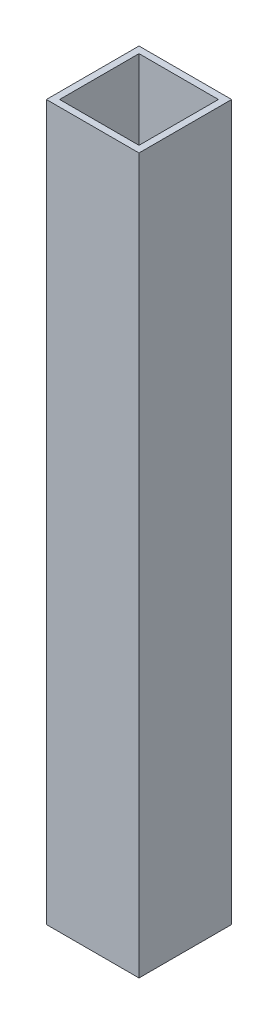
ISO-10303-21;
HEADER;
FILE_DESCRIPTION(('STEP AP214'),'2;1');
FILE_NAME('part.step','',(''),(''),'','','');
FILE_SCHEMA(('AUTOMOTIVE_DESIGN { 1 0 10303 214 1 1 1 1 }'));
ENDSEC;
DATA;
#1=APPLICATION_CONTEXT('core data for automotive mechanical design processes');
#2=APPLICATION_PROTOCOL_DEFINITION('international standard','automotive_design',2000,#1);
#3=PRODUCT_CONTEXT('',#1,'mechanical');
#4=PRODUCT('Part','Part','',(#3));
#5=PRODUCT_RELATED_PRODUCT_CATEGORY('part','',(#4));
#6=PRODUCT_DEFINITION_FORMATION('','',#4);
#7=PRODUCT_DEFINITION_CONTEXT('part definition',#1,'design');
#8=PRODUCT_DEFINITION('design','',#6,#7);
#9=PRODUCT_DEFINITION_SHAPE('','',#8);
#10=(LENGTH_UNIT() NAMED_UNIT(*) SI_UNIT(.MILLI.,.METRE.));
#11=(NAMED_UNIT(*) PLANE_ANGLE_UNIT() SI_UNIT($,.RADIAN.));
#12=(NAMED_UNIT(*) SI_UNIT($,.STERADIAN.) SOLID_ANGLE_UNIT());
#13=UNCERTAINTY_MEASURE_WITH_UNIT(LENGTH_MEASURE(1.E-05),#10,'distance_accuracy_value','');
#14=(GEOMETRIC_REPRESENTATION_CONTEXT(3) GLOBAL_UNCERTAINTY_ASSIGNED_CONTEXT((#13)) GLOBAL_UNIT_ASSIGNED_CONTEXT((#10,
#11,#12)) REPRESENTATION_CONTEXT('',''));
#15=CARTESIAN_POINT('',(0.,0.,0.));
#16=DIRECTION('',(0.,0.,1.));
#17=DIRECTION('',(1.,0.,0.));
#18=AXIS2_PLACEMENT_3D('',#15,#16,#17);
#19=CARTESIAN_POINT('',(-34.925,-342.9,41.275));
#20=DIRECTION('',(0.,0.,-1.));
#21=DIRECTION('',(-1.,0.,0.));
#22=AXIS2_PLACEMENT_3D('',#19,#20,#21);
#23=PLANE('',#22);
#24=DIRECTION('',(1.,0.,0.));
#25=VECTOR('',#24,1.);
#26=CARTESIAN_POINT('',(-34.925,-342.9,41.275));
#27=LINE('',#26,#25);
#28=CARTESIAN_POINT('',(-53.975,-342.9,41.275));
#29=VERTEX_POINT('',#28);
#30=CARTESIAN_POINT('',(-15.875,-342.9,41.275));
#31=VERTEX_POINT('',#30);
#32=EDGE_CURVE('E120',#29,#31,#27,.T.);
#33=ORIENTED_EDGE('',*,*,#32,.F.);
#34=DIRECTION('',(0.,1.,0.));
#35=VECTOR('',#34,1.);
#36=CARTESIAN_POINT('',(-53.975,-342.9,41.275));
#37=LINE('',#36,#35);
#38=CARTESIAN_POINT('',(-53.975,0.,41.275));
#39=VERTEX_POINT('',#38);
#40=EDGE_CURVE('E88',#29,#39,#37,.T.);
#41=ORIENTED_EDGE('',*,*,#40,.T.);
#42=DIRECTION('',(1.,0.,0.));
#43=VECTOR('',#42,1.);
#44=CARTESIAN_POINT('',(-34.925,0.,41.275));
#45=LINE('',#44,#43);
#46=CARTESIAN_POINT('',(-15.875,0.,41.275));
#47=VERTEX_POINT('',#46);
#48=EDGE_CURVE('E102',#39,#47,#45,.T.);
#49=ORIENTED_EDGE('',*,*,#48,.T.);
#50=DIRECTION('',(0.,1.,0.));
#51=VECTOR('',#50,1.);
#52=CARTESIAN_POINT('',(-15.875,-342.9,41.275));
#53=LINE('',#52,#51);
#54=EDGE_CURVE('E17',#31,#47,#53,.T.);
#55=ORIENTED_EDGE('',*,*,#54,.F.);
#56=EDGE_LOOP('',(#33,#41,#49,#55));
#57=FACE_BOUND('',#56,.T.);
#58=ADVANCED_FACE('F14',(#57),#23,.T.);
#59=CARTESIAN_POINT('',(-15.875,-342.9,22.225));
#60=DIRECTION('',(-1.,0.,0.));
#61=DIRECTION('',(0.,0.,1.));
#62=AXIS2_PLACEMENT_3D('',#59,#60,#61);
#63=PLANE('',#62);
#64=DIRECTION('',(0.,0.,-1.));
#65=VECTOR('',#64,1.);
#66=CARTESIAN_POINT('',(-15.875,-342.9,22.225));
#67=LINE('',#66,#65);
#68=CARTESIAN_POINT('',(-15.875,-342.9,3.175));
#69=VERTEX_POINT('',#68);
#70=EDGE_CURVE('E118',#31,#69,#67,.T.);
#71=ORIENTED_EDGE('',*,*,#70,.F.);
#72=ORIENTED_EDGE('',*,*,#54,.T.);
#73=DIRECTION('',(0.,0.,-1.));
#74=VECTOR('',#73,1.);
#75=CARTESIAN_POINT('',(-15.875,0.,22.225));
#76=LINE('',#75,#74);
#77=CARTESIAN_POINT('',(-15.875,0.,3.175));
#78=VERTEX_POINT('',#77);
#79=EDGE_CURVE('E79',#47,#78,#76,.T.);
#80=ORIENTED_EDGE('',*,*,#79,.T.);
#81=DIRECTION('',(0.,1.,0.));
#82=VECTOR('',#81,1.);
#83=CARTESIAN_POINT('',(-15.875,-342.9,3.175));
#84=LINE('',#83,#82);
#85=EDGE_CURVE('E82',#78,#69,#84,.F.);
#86=ORIENTED_EDGE('',*,*,#85,.T.);
#87=EDGE_LOOP('',(#71,#72,#80,#86));
#88=FACE_BOUND('',#87,.T.);
#89=ADVANCED_FACE('F81',(#88),#63,.T.);
#90=CARTESIAN_POINT('',(-34.925,-342.9,3.175));
#91=DIRECTION('',(0.,0.,-1.));
#92=DIRECTION('',(-1.,0.,0.));
#93=AXIS2_PLACEMENT_3D('',#90,#91,#92);
#94=PLANE('',#93);
#95=DIRECTION('',(0.,1.,0.));
#96=VECTOR('',#95,1.);
#97=CARTESIAN_POINT('',(-53.975,-342.9,3.175));
#98=LINE('',#97,#96);
#99=CARTESIAN_POINT('',(-53.975,0.,3.175));
#100=VERTEX_POINT('',#99);
#101=CARTESIAN_POINT('',(-53.975,-342.9,3.175));
#102=VERTEX_POINT('',#101);
#103=EDGE_CURVE('E96',#100,#102,#98,.F.);
#104=ORIENTED_EDGE('',*,*,#103,.T.);
#105=DIRECTION('',(1.,0.,0.));
#106=VECTOR('',#105,1.);
#107=CARTESIAN_POINT('',(-34.925,-342.9,3.175));
#108=LINE('',#107,#106);
#109=EDGE_CURVE('E94',#69,#102,#108,.F.);
#110=ORIENTED_EDGE('',*,*,#109,.F.);
#111=ORIENTED_EDGE('',*,*,#85,.F.);
#112=DIRECTION('',(1.,0.,0.));
#113=VECTOR('',#112,1.);
#114=CARTESIAN_POINT('',(-34.925,0.,3.175));
#115=LINE('',#114,#113);
#116=EDGE_CURVE('E87',#78,#100,#115,.F.);
#117=ORIENTED_EDGE('',*,*,#116,.T.);
#118=EDGE_LOOP('',(#104,#110,#111,#117));
#119=FACE_BOUND('',#118,.T.);
#120=ADVANCED_FACE('F91',(#119),#94,.F.);
#121=CARTESIAN_POINT('',(-53.975,-342.9,22.225));
#122=DIRECTION('',(-1.,0.,0.));
#123=DIRECTION('',(0.,0.,1.));
#124=AXIS2_PLACEMENT_3D('',#121,#122,#123);
#125=PLANE('',#124);
#126=ORIENTED_EDGE('',*,*,#40,.F.);
#127=DIRECTION('',(0.,0.,-1.));
#128=VECTOR('',#127,1.);
#129=CARTESIAN_POINT('',(-53.975,-342.9,22.225));
#130=LINE('',#129,#128);
#131=EDGE_CURVE('E111',#102,#29,#130,.F.);
#132=ORIENTED_EDGE('',*,*,#131,.F.);
#133=ORIENTED_EDGE('',*,*,#103,.F.);
#134=DIRECTION('',(0.,0.,-1.));
#135=VECTOR('',#134,1.);
#136=CARTESIAN_POINT('',(-53.975,0.,22.225));
#137=LINE('',#136,#135);
#138=EDGE_CURVE('E100',#100,#39,#137,.F.);
#139=ORIENTED_EDGE('',*,*,#138,.T.);
#140=EDGE_LOOP('',(#126,#132,#133,#139));
#141=FACE_BOUND('',#140,.T.);
#142=ADVANCED_FACE('F112',(#141),#125,.F.);
#143=CARTESIAN_POINT('',(-12.7,-342.9,22.225));
#144=DIRECTION('',(-1.,0.,0.));
#145=DIRECTION('',(0.,0.,1.));
#146=AXIS2_PLACEMENT_3D('',#143,#144,#145);
#147=PLANE('',#146);
#148=DIRECTION('',(0.,1.,0.));
#149=VECTOR('',#148,1.);
#150=CARTESIAN_POINT('',(-12.7,-342.9,44.45));
#151=LINE('',#150,#149);
#152=CARTESIAN_POINT('',(-12.7,0.,44.45));
#153=VERTEX_POINT('',#152);
#154=CARTESIAN_POINT('',(-12.7,-342.9,44.45));
#155=VERTEX_POINT('',#154);
#156=EDGE_CURVE('E230',#153,#155,#151,.F.);
#157=ORIENTED_EDGE('',*,*,#156,.T.);
#158=DIRECTION('',(0.,0.,-1.));
#159=VECTOR('',#158,1.);
#160=CARTESIAN_POINT('',(-12.7,-342.9,22.225));
#161=LINE('',#160,#159);
#162=CARTESIAN_POINT('',(-12.7,-342.9,0.));
#163=VERTEX_POINT('',#162);
#164=EDGE_CURVE('E232',#163,#155,#161,.F.);
#165=ORIENTED_EDGE('',*,*,#164,.F.);
#166=DIRECTION('',(0.,1.,0.));
#167=VECTOR('',#166,1.);
#168=CARTESIAN_POINT('',(-12.7,-342.9,0.));
#169=LINE('',#168,#167);
#170=CARTESIAN_POINT('',(-12.7,0.,0.));
#171=VERTEX_POINT('',#170);
#172=EDGE_CURVE('E125',#171,#163,#169,.F.);
#173=ORIENTED_EDGE('',*,*,#172,.F.);
#174=DIRECTION('',(0.,0.,-1.));
#175=VECTOR('',#174,1.);
#176=CARTESIAN_POINT('',(-12.7,0.,22.225));
#177=LINE('',#176,#175);
#178=EDGE_CURVE('E130',#171,#153,#177,.F.);
#179=ORIENTED_EDGE('',*,*,#178,.T.);
#180=EDGE_LOOP('',(#157,#165,#173,#179));
#181=FACE_BOUND('',#180,.T.);
#182=ADVANCED_FACE('F157',(#181),#147,.F.);
#183=CARTESIAN_POINT('',(-34.925,0.,22.225));
#184=DIRECTION('',(0.,-1.,0.));
#185=DIRECTION('',(0.,0.,-1.));
#186=AXIS2_PLACEMENT_3D('',#183,#184,#185);
#187=PLANE('',#186);
#188=DIRECTION('',(0.,0.,1.));
#189=VECTOR('',#188,1.);
#190=CARTESIAN_POINT('',(-57.15,0.,22.225));
#191=LINE('',#190,#189);
#192=CARTESIAN_POINT('',(-57.15,0.,44.45));
#193=VERTEX_POINT('',#192);
#194=CARTESIAN_POINT('',(-57.15,0.,0.));
#195=VERTEX_POINT('',#194);
#196=EDGE_CURVE('E240',#193,#195,#191,.F.);
#197=ORIENTED_EDGE('',*,*,#196,.F.);
#198=DIRECTION('',(-1.,0.,0.));
#199=VECTOR('',#198,1.);
#200=CARTESIAN_POINT('',(-34.925,0.,44.45));
#201=LINE('',#200,#199);
#202=EDGE_CURVE('E238',#193,#153,#201,.F.);
#203=ORIENTED_EDGE('',*,*,#202,.T.);
#204=ORIENTED_EDGE('',*,*,#178,.F.);
#205=DIRECTION('',(-1.,0.,0.));
#206=VECTOR('',#205,1.);
#207=CARTESIAN_POINT('',(-34.925,0.,0.));
#208=LINE('',#207,#206);
#209=EDGE_CURVE('E127',#195,#171,#208,.F.);
#210=ORIENTED_EDGE('',*,*,#209,.F.);
#211=EDGE_LOOP('',(#197,#203,#204,#210));
#212=FACE_BOUND('',#211,.T.);
#213=ORIENTED_EDGE('',*,*,#138,.F.);
#214=ORIENTED_EDGE('',*,*,#116,.F.);
#215=ORIENTED_EDGE('',*,*,#79,.F.);
#216=ORIENTED_EDGE('',*,*,#48,.F.);
#217=EDGE_LOOP('',(#213,#214,#215,#216));
#218=FACE_BOUND('',#217,.T.);
#219=ADVANCED_FACE('F98',(#212,#218),#187,.F.);
#220=CARTESIAN_POINT('',(-34.925,-342.9,0.));
#221=DIRECTION('',(0.,0.,-1.));
#222=DIRECTION('',(-1.,0.,0.));
#223=AXIS2_PLACEMENT_3D('',#220,#221,#222);
#224=PLANE('',#223);
#225=DIRECTION('',(1.,0.,0.));
#226=VECTOR('',#225,1.);
#227=CARTESIAN_POINT('',(-34.925,-342.9,0.));
#228=LINE('',#227,#226);
#229=CARTESIAN_POINT('',(-57.15,-342.9,0.));
#230=VERTEX_POINT('',#229);
#231=EDGE_CURVE('E115',#230,#163,#228,.T.);
#232=ORIENTED_EDGE('',*,*,#231,.F.);
#233=DIRECTION('',(0.,1.,0.));
#234=VECTOR('',#233,1.);
#235=CARTESIAN_POINT('',(-57.15,-342.9,0.));
#236=LINE('',#235,#234);
#237=EDGE_CURVE('E245',#195,#230,#236,.F.);
#238=ORIENTED_EDGE('',*,*,#237,.F.);
#239=ORIENTED_EDGE('',*,*,#209,.T.);
#240=ORIENTED_EDGE('',*,*,#172,.T.);
#241=EDGE_LOOP('',(#232,#238,#239,#240));
#242=FACE_BOUND('',#241,.T.);
#243=ADVANCED_FACE('F151',(#242),#224,.T.);
#244=CARTESIAN_POINT('',(-34.925,-342.9,22.225));
#245=DIRECTION('',(0.,-1.,0.));
#246=DIRECTION('',(0.,0.,-1.));
#247=AXIS2_PLACEMENT_3D('',#244,#245,#246);
#248=PLANE('',#247);
#249=DIRECTION('',(-1.,0.,0.));
#250=VECTOR('',#249,1.);
#251=CARTESIAN_POINT('',(-34.925,-342.9,44.45));
#252=LINE('',#251,#250);
#253=CARTESIAN_POINT('',(-57.15,-342.9,44.45));
#254=VERTEX_POINT('',#253);
#255=EDGE_CURVE('E32',#155,#254,#252,.T.);
#256=ORIENTED_EDGE('',*,*,#255,.T.);
#257=DIRECTION('',(0.,0.,1.));
#258=VECTOR('',#257,1.);
#259=CARTESIAN_POINT('',(-57.15,-342.9,22.225));
#260=LINE('',#259,#258);
#261=EDGE_CURVE('E23',#230,#254,#260,.T.);
#262=ORIENTED_EDGE('',*,*,#261,.F.);
#263=ORIENTED_EDGE('',*,*,#231,.T.);
#264=ORIENTED_EDGE('',*,*,#164,.T.);
#265=EDGE_LOOP('',(#256,#262,#263,#264));
#266=FACE_BOUND('',#265,.T.);
#267=ORIENTED_EDGE('',*,*,#109,.T.);
#268=ORIENTED_EDGE('',*,*,#131,.T.);
#269=ORIENTED_EDGE('',*,*,#32,.T.);
#270=ORIENTED_EDGE('',*,*,#70,.T.);
#271=EDGE_LOOP('',(#267,#268,#269,#270));
#272=FACE_BOUND('',#271,.T.);
#273=ADVANCED_FACE('F117',(#266,#272),#248,.T.);
#274=CARTESIAN_POINT('',(-34.925,-342.9,44.45));
#275=DIRECTION('',(0.,0.,-1.));
#276=DIRECTION('',(-1.,0.,0.));
#277=AXIS2_PLACEMENT_3D('',#274,#275,#276);
#278=PLANE('',#277);
#279=DIRECTION('',(0.,1.,0.));
#280=VECTOR('',#279,1.);
#281=CARTESIAN_POINT('',(-57.15,-342.9,44.45));
#282=LINE('',#281,#280);
#283=EDGE_CURVE('E9',#254,#193,#282,.T.);
#284=ORIENTED_EDGE('',*,*,#283,.F.);
#285=ORIENTED_EDGE('',*,*,#255,.F.);
#286=ORIENTED_EDGE('',*,*,#156,.F.);
#287=ORIENTED_EDGE('',*,*,#202,.F.);
#288=EDGE_LOOP('',(#284,#285,#286,#287));
#289=FACE_BOUND('',#288,.T.);
#290=ADVANCED_FACE('F139',(#289),#278,.F.);
#291=CARTESIAN_POINT('',(-57.15,-342.9,22.225));
#292=DIRECTION('',(-1.,0.,0.));
#293=DIRECTION('',(0.,0.,1.));
#294=AXIS2_PLACEMENT_3D('',#291,#292,#293);
#295=PLANE('',#294);
#296=ORIENTED_EDGE('',*,*,#261,.T.);
#297=ORIENTED_EDGE('',*,*,#283,.T.);
#298=ORIENTED_EDGE('',*,*,#196,.T.);
#299=ORIENTED_EDGE('',*,*,#237,.T.);
#300=EDGE_LOOP('',(#296,#297,#298,#299));
#301=FACE_BOUND('',#300,.T.);
#302=ADVANCED_FACE('F137',(#301),#295,.T.);
#303=CLOSED_SHELL('',(#58,#89,#120,#142,#182,#219,#243,#273,#290,#302));
#304=MANIFOLD_SOLID_BREP('B1',#303);
#305=ADVANCED_BREP_SHAPE_REPRESENTATION('',(#18,#304),#14);
#306=SHAPE_DEFINITION_REPRESENTATION(#9,#305);
ENDSEC;
END-ISO-10303-21;
